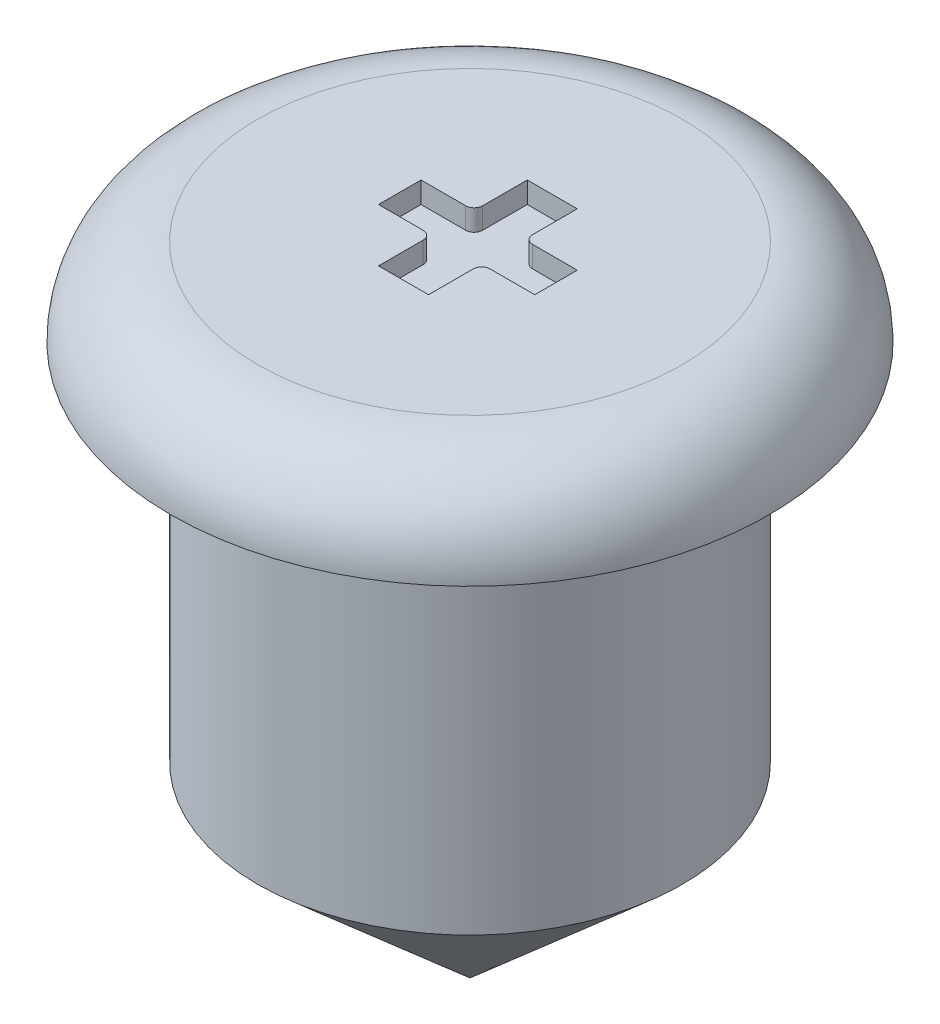
ISO-10303-21;
HEADER;
FILE_DESCRIPTION(('STEP AP214'),'2;1');
FILE_NAME('part.step','',(''),(''),'','','');
FILE_SCHEMA(('AUTOMOTIVE_DESIGN { 1 0 10303 214 1 1 1 1 }'));
ENDSEC;
DATA;
#1=APPLICATION_CONTEXT('core data for automotive mechanical design processes');
#2=APPLICATION_PROTOCOL_DEFINITION('international standard','automotive_design',2000,#1);
#3=PRODUCT_CONTEXT('',#1,'mechanical');
#4=PRODUCT('Part','Part','',(#3));
#5=PRODUCT_RELATED_PRODUCT_CATEGORY('part','',(#4));
#6=PRODUCT_DEFINITION_FORMATION('','',#4);
#7=PRODUCT_DEFINITION_CONTEXT('part definition',#1,'design');
#8=PRODUCT_DEFINITION('design','',#6,#7);
#9=PRODUCT_DEFINITION_SHAPE('','',#8);
#10=(LENGTH_UNIT() NAMED_UNIT(*) SI_UNIT(.MILLI.,.METRE.));
#11=(NAMED_UNIT(*) PLANE_ANGLE_UNIT() SI_UNIT($,.RADIAN.));
#12=(NAMED_UNIT(*) SI_UNIT($,.STERADIAN.) SOLID_ANGLE_UNIT());
#13=UNCERTAINTY_MEASURE_WITH_UNIT(LENGTH_MEASURE(1.E-05),#10,'distance_accuracy_value','');
#14=(GEOMETRIC_REPRESENTATION_CONTEXT(3) GLOBAL_UNCERTAINTY_ASSIGNED_CONTEXT((#13)) GLOBAL_UNIT_ASSIGNED_CONTEXT((#10,
#11,#12)) REPRESENTATION_CONTEXT('',''));
#15=CARTESIAN_POINT('',(0.,0.,0.));
#16=DIRECTION('',(0.,0.,1.));
#17=DIRECTION('',(1.,0.,0.));
#18=AXIS2_PLACEMENT_3D('',#15,#16,#17);
#19=CARTESIAN_POINT('',(0.,-15.8999296053397,0.));
#20=DIRECTION('',(0.,1.,0.));
#21=DIRECTION('',(0.,0.,1.));
#22=AXIS2_PLACEMENT_3D('',#19,#20,#21);
#23=CONICAL_SURFACE('',#22,0.,0.848129261083657);
#24=CARTESIAN_POINT('',(0.,-15.018131929424,0.));
#25=DIRECTION('',(0.,1.,0.));
#26=DIRECTION('',(0.,0.,1.));
#27=AXIS2_PLACEMENT_3D('',#24,#25,#26);
#28=CIRCLE('',#27,1.);
#29=CARTESIAN_POINT('',(0.,-15.018131929424,1.));
#30=VERTEX_POINT('',#29);
#31=EDGE_CURVE('E11',#30,#30,#28,.T.);
#32=ORIENTED_EDGE('',*,*,#31,.F.);
#33=EDGE_LOOP('',(#32));
#34=FACE_BOUND('',#33,.T.);
#35=CARTESIAN_POINT('',(0.,-15.8999296053397,0.));
#36=VERTEX_POINT('',#35);
#37=VERTEX_LOOP('',#36);
#38=FACE_BOUND('',#37,.T.);
#39=ADVANCED_FACE('F45',(#34,#38),#23,.T.);
#40=CARTESIAN_POINT('',(0.,-12.8999296053397,0.));
#41=DIRECTION('',(0.,1.,0.));
#42=DIRECTION('',(0.,0.,1.));
#43=AXIS2_PLACEMENT_3D('',#40,#41,#42);
#44=CYLINDRICAL_SURFACE('',#43,1.);
#45=CARTESIAN_POINT('',(0.,-13.3080014136376,0.));
#46=DIRECTION('',(0.,1.,0.));
#47=DIRECTION('',(0.,0.,1.));
#48=AXIS2_PLACEMENT_3D('',#45,#46,#47);
#49=CIRCLE('',#48,1.);
#50=CARTESIAN_POINT('',(0.,-13.3080014136376,1.));
#51=VERTEX_POINT('',#50);
#52=EDGE_CURVE('E52',#51,#51,#49,.T.);
#53=ORIENTED_EDGE('',*,*,#52,.F.);
#54=EDGE_LOOP('',(#53));
#55=FACE_BOUND('',#54,.T.);
#56=ORIENTED_EDGE('',*,*,#31,.T.);
#57=EDGE_LOOP('',(#56));
#58=FACE_BOUND('',#57,.T.);
#59=ADVANCED_FACE('F301',(#55,#58),#44,.T.);
#60=CARTESIAN_POINT('',(1.40807180829788,-13.3080014136376,0.));
#61=DIRECTION('',(0.,1.,0.));
#62=DIRECTION('',(0.,0.,1.));
#63=AXIS2_PLACEMENT_3D('',#60,#61,#62);
#64=PLANE('',#63);
#65=CARTESIAN_POINT('',(0.,-13.3080014136376,0.));
#66=DIRECTION('',(0.,1.,0.));
#67=DIRECTION('',(0.,0.,1.));
#68=AXIS2_PLACEMENT_3D('',#65,#66,#67);
#69=CIRCLE('',#68,1.40807180829788);
#70=CARTESIAN_POINT('',(0.,-13.3080014136376,1.40807180829788));
#71=VERTEX_POINT('',#70);
#72=EDGE_CURVE('E294',#71,#71,#69,.T.);
#73=ORIENTED_EDGE('',*,*,#72,.F.);
#74=EDGE_LOOP('',(#73));
#75=FACE_BOUND('',#74,.T.);
#76=ORIENTED_EDGE('',*,*,#52,.T.);
#77=EDGE_LOOP('',(#76));
#78=FACE_BOUND('',#77,.T.);
#79=ADVANCED_FACE('F299',(#75,#78),#64,.F.);
#80=CARTESIAN_POINT('',(0.,-13.3080014136376,0.));
#81=DIRECTION('',(0.,1.,0.));
#82=DIRECTION('',(0.,0.,1.));
#83=AXIS2_PLACEMENT_3D('',#80,#81,#82);
#84=TOROIDAL_SURFACE('',#83,1.,0.408071808297883);
#85=CARTESIAN_POINT('',(0.,-12.8999296053397,0.));
#86=DIRECTION('',(0.,1.,0.));
#87=DIRECTION('',(0.,0.,1.));
#88=AXIS2_PLACEMENT_3D('',#85,#86,#87);
#89=CIRCLE('',#88,1.);
#90=CARTESIAN_POINT('',(0.,-12.8999296053397,1.));
#91=VERTEX_POINT('',#90);
#92=EDGE_CURVE('E264',#91,#91,#89,.T.);
#93=ORIENTED_EDGE('',*,*,#92,.F.);
#94=EDGE_LOOP('',(#93));
#95=FACE_BOUND('',#94,.T.);
#96=ORIENTED_EDGE('',*,*,#72,.T.);
#97=EDGE_LOOP('',(#96));
#98=FACE_BOUND('',#97,.T.);
#99=ADVANCED_FACE('F320',(#95,#98),#84,.T.);
#100=CARTESIAN_POINT('',(1.,-12.8999296053397,0.));
#101=DIRECTION('',(0.,-1.,0.));
#102=DIRECTION('',(0.,0.,-1.));
#103=AXIS2_PLACEMENT_3D('',#100,#101,#102);
#104=PLANE('',#103);
#105=DIRECTION('',(-1.,0.,0.));
#106=VECTOR('',#105,1.);
#107=CARTESIAN_POINT('',(-0.117632759443697,-12.8999296053397,-0.387224573028196));
#108=LINE('',#107,#106);
#109=CARTESIAN_POINT('',(0.117632759443697,-12.8999296053397,-0.387224573028196));
#110=VERTEX_POINT('',#109);
#111=CARTESIAN_POINT('',(-0.117632759443697,-12.8999296053397,-0.387224573028196));
#112=VERTEX_POINT('',#111);
#113=EDGE_CURVE('E222',#110,#112,#108,.T.);
#114=ORIENTED_EDGE('',*,*,#113,.F.);
#115=DIRECTION('',(0.,0.,-1.));
#116=VECTOR('',#115,1.);
#117=CARTESIAN_POINT('',(0.117632759443697,-12.8999296053397,-0.387224573028196));
#118=LINE('',#117,#116);
#119=CARTESIAN_POINT('',(0.117632759443697,-12.8999296053397,-0.177224573028196));
#120=VERTEX_POINT('',#119);
#121=EDGE_CURVE('E59',#120,#110,#118,.T.);
#122=ORIENTED_EDGE('',*,*,#121,.F.);
#123=CARTESIAN_POINT('',(0.157632759443697,-12.8999296053397,-0.177224573028196));
#124=DIRECTION('',(0.,-1.,0.));
#125=DIRECTION('',(0.,0.,1.));
#126=AXIS2_PLACEMENT_3D('',#123,#124,#125);
#127=CIRCLE('',#126,0.04);
#128=CARTESIAN_POINT('',(0.157632759443697,-12.8999296053397,-0.137224573028196));
#129=VERTEX_POINT('',#128);
#130=EDGE_CURVE('E178',#129,#120,#127,.T.);
#131=ORIENTED_EDGE('',*,*,#130,.F.);
#132=DIRECTION('',(-1.,0.,0.));
#133=VECTOR('',#132,1.);
#134=CARTESIAN_POINT('',(0.157632759443697,-12.8999296053397,-0.137224573028196));
#135=LINE('',#134,#133);
#136=CARTESIAN_POINT('',(0.367632759443697,-12.8999296053397,-0.137224573028196));
#137=VERTEX_POINT('',#136);
#138=EDGE_CURVE('E181',#137,#129,#135,.T.);
#139=ORIENTED_EDGE('',*,*,#138,.F.);
#140=DIRECTION('',(0.,0.,-1.));
#141=VECTOR('',#140,1.);
#142=CARTESIAN_POINT('',(0.367632759443697,-12.8999296053397,-0.137224573028196));
#143=LINE('',#142,#141);
#144=CARTESIAN_POINT('',(0.367632759443697,-12.8999296053397,0.0627754269718038));
#145=VERTEX_POINT('',#144);
#146=EDGE_CURVE('E257',#145,#137,#143,.T.);
#147=ORIENTED_EDGE('',*,*,#146,.F.);
#148=DIRECTION('',(1.,0.,0.));
#149=VECTOR('',#148,1.);
#150=CARTESIAN_POINT('',(0.367632759443697,-12.8999296053397,0.0627754269718038));
#151=LINE('',#150,#149);
#152=CARTESIAN_POINT('',(0.157632759443697,-12.8999296053397,0.0627754269718039));
#153=VERTEX_POINT('',#152);
#154=EDGE_CURVE('E254',#153,#145,#151,.T.);
#155=ORIENTED_EDGE('',*,*,#154,.F.);
#156=CARTESIAN_POINT('',(0.157632759443697,-12.8999296053397,0.102775426971804));
#157=DIRECTION('',(0.,-1.,0.));
#158=DIRECTION('',(0.,0.,1.));
#159=AXIS2_PLACEMENT_3D('',#156,#157,#158);
#160=CIRCLE('',#159,0.04);
#161=CARTESIAN_POINT('',(0.117632759443697,-12.8999296053397,0.102775426971804));
#162=VERTEX_POINT('',#161);
#163=EDGE_CURVE('E251',#162,#153,#160,.T.);
#164=ORIENTED_EDGE('',*,*,#163,.F.);
#165=DIRECTION('',(0.,0.,-1.));
#166=VECTOR('',#165,1.);
#167=CARTESIAN_POINT('',(0.117632759443697,-12.8999296053397,0.102775426971804));
#168=LINE('',#167,#166);
#169=CARTESIAN_POINT('',(0.117632759443697,-12.8999296053397,0.312775426971804));
#170=VERTEX_POINT('',#169);
#171=EDGE_CURVE('E248',#170,#162,#168,.T.);
#172=ORIENTED_EDGE('',*,*,#171,.F.);
#173=DIRECTION('',(1.,0.,0.));
#174=VECTOR('',#173,1.);
#175=CARTESIAN_POINT('',(0.117632759443697,-12.8999296053397,0.312775426971804));
#176=LINE('',#175,#174);
#177=CARTESIAN_POINT('',(-0.117632759443697,-12.8999296053397,0.312775426971804));
#178=VERTEX_POINT('',#177);
#179=EDGE_CURVE('E245',#178,#170,#176,.T.);
#180=ORIENTED_EDGE('',*,*,#179,.F.);
#181=DIRECTION('',(0.,0.,1.));
#182=VECTOR('',#181,1.);
#183=CARTESIAN_POINT('',(-0.117632759443697,-12.8999296053397,0.102775426971804));
#184=LINE('',#183,#182);
#185=CARTESIAN_POINT('',(-0.117632759443697,-12.8999296053397,0.102775426971804));
#186=VERTEX_POINT('',#185);
#187=EDGE_CURVE('E242',#186,#178,#184,.T.);
#188=ORIENTED_EDGE('',*,*,#187,.F.);
#189=CARTESIAN_POINT('',(-0.157632759443697,-12.8999296053397,0.102775426971804));
#190=DIRECTION('',(0.,-1.,0.));
#191=DIRECTION('',(0.,0.,-1.));
#192=AXIS2_PLACEMENT_3D('',#189,#190,#191);
#193=CIRCLE('',#192,0.04);
#194=CARTESIAN_POINT('',(-0.157632759443697,-12.8999296053397,0.0627754269718039));
#195=VERTEX_POINT('',#194);
#196=EDGE_CURVE('E239',#195,#186,#193,.T.);
#197=ORIENTED_EDGE('',*,*,#196,.F.);
#198=DIRECTION('',(1.,0.,0.));
#199=VECTOR('',#198,1.);
#200=CARTESIAN_POINT('',(-0.367632759443697,-12.8999296053397,0.0627754269718039));
#201=LINE('',#200,#199);
#202=CARTESIAN_POINT('',(-0.367632759443697,-12.8999296053397,0.0627754269718039));
#203=VERTEX_POINT('',#202);
#204=EDGE_CURVE('E236',#203,#195,#201,.T.);
#205=ORIENTED_EDGE('',*,*,#204,.F.);
#206=DIRECTION('',(0.,0.,1.));
#207=VECTOR('',#206,1.);
#208=CARTESIAN_POINT('',(-0.367632759443697,-12.8999296053397,-0.137224573028196));
#209=LINE('',#208,#207);
#210=CARTESIAN_POINT('',(-0.367632759443697,-12.8999296053397,-0.137224573028196));
#211=VERTEX_POINT('',#210);
#212=EDGE_CURVE('E233',#211,#203,#209,.T.);
#213=ORIENTED_EDGE('',*,*,#212,.F.);
#214=DIRECTION('',(-1.,0.,0.));
#215=VECTOR('',#214,1.);
#216=CARTESIAN_POINT('',(-0.157632759443697,-12.8999296053397,-0.137224573028196));
#217=LINE('',#216,#215);
#218=CARTESIAN_POINT('',(-0.157632759443697,-12.8999296053397,-0.137224573028196));
#219=VERTEX_POINT('',#218);
#220=EDGE_CURVE('E230',#219,#211,#217,.T.);
#221=ORIENTED_EDGE('',*,*,#220,.F.);
#222=CARTESIAN_POINT('',(-0.157632759443697,-12.8999296053397,-0.177224573028196));
#223=DIRECTION('',(0.,-1.,0.));
#224=DIRECTION('',(0.,0.,-1.));
#225=AXIS2_PLACEMENT_3D('',#222,#223,#224);
#226=CIRCLE('',#225,0.04);
#227=CARTESIAN_POINT('',(-0.117632759443697,-12.8999296053397,-0.177224573028196));
#228=VERTEX_POINT('',#227);
#229=EDGE_CURVE('E227',#228,#219,#226,.T.);
#230=ORIENTED_EDGE('',*,*,#229,.F.);
#231=DIRECTION('',(0.,0.,1.));
#232=VECTOR('',#231,1.);
#233=CARTESIAN_POINT('',(-0.117632759443697,-12.8999296053397,-0.387224573028196));
#234=LINE('',#233,#232);
#235=EDGE_CURVE('E224',#112,#228,#234,.T.);
#236=ORIENTED_EDGE('',*,*,#235,.F.);
#237=EDGE_LOOP('',(#114,#122,#131,#139,#147,#155,#164,#172,#180,#188,#197,#205,#213,#221,#230,#236));
#238=FACE_BOUND('',#237,.T.);
#239=ORIENTED_EDGE('',*,*,#92,.T.);
#240=EDGE_LOOP('',(#239));
#241=FACE_BOUND('',#240,.T.);
#242=ADVANCED_FACE('F329',(#238,#241),#104,.F.);
#243=CARTESIAN_POINT('',(0.117632759443697,-12.9999296053397,-0.387224573028196));
#244=DIRECTION('',(1.,0.,0.));
#245=DIRECTION('',(0.,0.,-1.));
#246=AXIS2_PLACEMENT_3D('',#243,#244,#245);
#247=PLANE('',#246);
#248=ORIENTED_EDGE('',*,*,#121,.T.);
#249=DIRECTION('',(0.,1.,0.));
#250=VECTOR('',#249,1.);
#251=CARTESIAN_POINT('',(0.117632759443697,-12.9999296053397,-0.387224573028196));
#252=LINE('',#251,#250);
#253=CARTESIAN_POINT('',(0.117632759443697,-12.9999296053397,-0.387224573028196));
#254=VERTEX_POINT('',#253);
#255=EDGE_CURVE('E155',#254,#110,#252,.T.);
#256=ORIENTED_EDGE('',*,*,#255,.F.);
#257=DIRECTION('',(0.,0.,-1.));
#258=VECTOR('',#257,1.);
#259=CARTESIAN_POINT('',(0.117632759443697,-12.9999296053397,-0.387224573028196));
#260=LINE('',#259,#258);
#261=CARTESIAN_POINT('',(0.117632759443697,-12.9999296053397,-0.177224573028196));
#262=VERTEX_POINT('',#261);
#263=EDGE_CURVE('E159',#262,#254,#260,.T.);
#264=ORIENTED_EDGE('',*,*,#263,.F.);
#265=DIRECTION('',(0.,1.,0.));
#266=VECTOR('',#265,1.);
#267=CARTESIAN_POINT('',(0.117632759443697,-12.9999296053397,-0.177224573028196));
#268=LINE('',#267,#266);
#269=EDGE_CURVE('E262',#262,#120,#268,.T.);
#270=ORIENTED_EDGE('',*,*,#269,.T.);
#271=EDGE_LOOP('',(#248,#256,#264,#270));
#272=FACE_BOUND('',#271,.T.);
#273=ADVANCED_FACE('F157',(#272),#247,.F.);
#274=CARTESIAN_POINT('',(0.157632759443697,-12.9999296053397,-0.177224573028196));
#275=DIRECTION('',(0.,1.,0.));
#276=DIRECTION('',(0.,0.,1.));
#277=AXIS2_PLACEMENT_3D('',#274,#275,#276);
#278=CYLINDRICAL_SURFACE('',#277,0.04);
#279=ORIENTED_EDGE('',*,*,#130,.T.);
#280=ORIENTED_EDGE('',*,*,#269,.F.);
#281=CARTESIAN_POINT('',(0.157632759443697,-12.9999296053397,-0.177224573028196));
#282=DIRECTION('',(0.,-1.,0.));
#283=DIRECTION('',(0.,0.,1.));
#284=AXIS2_PLACEMENT_3D('',#281,#282,#283);
#285=CIRCLE('',#284,0.04);
#286=CARTESIAN_POINT('',(0.157632759443697,-12.9999296053397,-0.137224573028196));
#287=VERTEX_POINT('',#286);
#288=EDGE_CURVE('E165',#287,#262,#285,.T.);
#289=ORIENTED_EDGE('',*,*,#288,.F.);
#290=DIRECTION('',(0.,1.,0.));
#291=VECTOR('',#290,1.);
#292=CARTESIAN_POINT('',(0.157632759443697,-12.9999296053397,-0.137224573028196));
#293=LINE('',#292,#291);
#294=EDGE_CURVE('E265',#287,#129,#293,.T.);
#295=ORIENTED_EDGE('',*,*,#294,.T.);
#296=EDGE_LOOP('',(#279,#280,#289,#295));
#297=FACE_BOUND('',#296,.T.);
#298=ADVANCED_FACE('F344',(#297),#278,.T.);
#299=CARTESIAN_POINT('',(0.157632759443697,-12.9999296053397,-0.137224573028196));
#300=DIRECTION('',(0.,0.,-1.));
#301=DIRECTION('',(-1.,0.,0.));
#302=AXIS2_PLACEMENT_3D('',#299,#300,#301);
#303=PLANE('',#302);
#304=ORIENTED_EDGE('',*,*,#138,.T.);
#305=ORIENTED_EDGE('',*,*,#294,.F.);
#306=DIRECTION('',(-1.,0.,0.));
#307=VECTOR('',#306,1.);
#308=CARTESIAN_POINT('',(0.157632759443697,-12.9999296053397,-0.137224573028196));
#309=LINE('',#308,#307);
#310=CARTESIAN_POINT('',(0.367632759443697,-12.9999296053397,-0.137224573028196));
#311=VERTEX_POINT('',#310);
#312=EDGE_CURVE('E218',#311,#287,#309,.T.);
#313=ORIENTED_EDGE('',*,*,#312,.F.);
#314=DIRECTION('',(0.,1.,0.));
#315=VECTOR('',#314,1.);
#316=CARTESIAN_POINT('',(0.367632759443697,-12.9999296053397,-0.137224573028196));
#317=LINE('',#316,#315);
#318=EDGE_CURVE('E267',#311,#137,#317,.T.);
#319=ORIENTED_EDGE('',*,*,#318,.T.);
#320=EDGE_LOOP('',(#304,#305,#313,#319));
#321=FACE_BOUND('',#320,.T.);
#322=ADVANCED_FACE('F351',(#321),#303,.F.);
#323=CARTESIAN_POINT('',(0.367632759443697,-12.9999296053397,-0.137224573028196));
#324=DIRECTION('',(1.,0.,0.));
#325=DIRECTION('',(0.,0.,-1.));
#326=AXIS2_PLACEMENT_3D('',#323,#324,#325);
#327=PLANE('',#326);
#328=ORIENTED_EDGE('',*,*,#146,.T.);
#329=ORIENTED_EDGE('',*,*,#318,.F.);
#330=DIRECTION('',(0.,0.,-1.));
#331=VECTOR('',#330,1.);
#332=CARTESIAN_POINT('',(0.367632759443697,-12.9999296053397,-0.137224573028196));
#333=LINE('',#332,#331);
#334=CARTESIAN_POINT('',(0.367632759443697,-12.9999296053397,0.0627754269718038));
#335=VERTEX_POINT('',#334);
#336=EDGE_CURVE('E215',#335,#311,#333,.T.);
#337=ORIENTED_EDGE('',*,*,#336,.F.);
#338=DIRECTION('',(0.,1.,0.));
#339=VECTOR('',#338,1.);
#340=CARTESIAN_POINT('',(0.367632759443697,-12.9999296053397,0.0627754269718038));
#341=LINE('',#340,#339);
#342=EDGE_CURVE('E269',#335,#145,#341,.T.);
#343=ORIENTED_EDGE('',*,*,#342,.T.);
#344=EDGE_LOOP('',(#328,#329,#337,#343));
#345=FACE_BOUND('',#344,.T.);
#346=ADVANCED_FACE('F359',(#345),#327,.F.);
#347=CARTESIAN_POINT('',(0.367632759443697,-12.9999296053397,0.0627754269718038));
#348=DIRECTION('',(0.,0.,1.));
#349=DIRECTION('',(1.,0.,0.));
#350=AXIS2_PLACEMENT_3D('',#347,#348,#349);
#351=PLANE('',#350);
#352=ORIENTED_EDGE('',*,*,#154,.T.);
#353=ORIENTED_EDGE('',*,*,#342,.F.);
#354=DIRECTION('',(1.,0.,0.));
#355=VECTOR('',#354,1.);
#356=CARTESIAN_POINT('',(0.367632759443697,-12.9999296053397,0.0627754269718038));
#357=LINE('',#356,#355);
#358=CARTESIAN_POINT('',(0.157632759443697,-12.9999296053397,0.0627754269718039));
#359=VERTEX_POINT('',#358);
#360=EDGE_CURVE('E212',#359,#335,#357,.T.);
#361=ORIENTED_EDGE('',*,*,#360,.F.);
#362=DIRECTION('',(0.,1.,0.));
#363=VECTOR('',#362,1.);
#364=CARTESIAN_POINT('',(0.157632759443697,-12.9999296053397,0.0627754269718039));
#365=LINE('',#364,#363);
#366=EDGE_CURVE('E271',#359,#153,#365,.T.);
#367=ORIENTED_EDGE('',*,*,#366,.T.);
#368=EDGE_LOOP('',(#352,#353,#361,#367));
#369=FACE_BOUND('',#368,.T.);
#370=ADVANCED_FACE('F367',(#369),#351,.F.);
#371=CARTESIAN_POINT('',(0.157632759443697,-12.9999296053397,0.102775426971804));
#372=DIRECTION('',(0.,1.,0.));
#373=DIRECTION('',(0.,0.,1.));
#374=AXIS2_PLACEMENT_3D('',#371,#372,#373);
#375=CYLINDRICAL_SURFACE('',#374,0.04);
#376=ORIENTED_EDGE('',*,*,#163,.T.);
#377=ORIENTED_EDGE('',*,*,#366,.F.);
#378=CARTESIAN_POINT('',(0.157632759443697,-12.9999296053397,0.102775426971804));
#379=DIRECTION('',(0.,-1.,0.));
#380=DIRECTION('',(0.,0.,1.));
#381=AXIS2_PLACEMENT_3D('',#378,#379,#380);
#382=CIRCLE('',#381,0.04);
#383=CARTESIAN_POINT('',(0.117632759443697,-12.9999296053397,0.102775426971804));
#384=VERTEX_POINT('',#383);
#385=EDGE_CURVE('E209',#384,#359,#382,.T.);
#386=ORIENTED_EDGE('',*,*,#385,.F.);
#387=DIRECTION('',(0.,1.,0.));
#388=VECTOR('',#387,1.);
#389=CARTESIAN_POINT('',(0.117632759443697,-12.9999296053397,0.102775426971804));
#390=LINE('',#389,#388);
#391=EDGE_CURVE('E273',#384,#162,#390,.T.);
#392=ORIENTED_EDGE('',*,*,#391,.T.);
#393=EDGE_LOOP('',(#376,#377,#386,#392));
#394=FACE_BOUND('',#393,.T.);
#395=ADVANCED_FACE('F375',(#394),#375,.T.);
#396=CARTESIAN_POINT('',(0.117632759443697,-12.9999296053397,0.102775426971804));
#397=DIRECTION('',(1.,0.,0.));
#398=DIRECTION('',(0.,0.,-1.));
#399=AXIS2_PLACEMENT_3D('',#396,#397,#398);
#400=PLANE('',#399);
#401=ORIENTED_EDGE('',*,*,#171,.T.);
#402=ORIENTED_EDGE('',*,*,#391,.F.);
#403=DIRECTION('',(0.,0.,-1.));
#404=VECTOR('',#403,1.);
#405=CARTESIAN_POINT('',(0.117632759443697,-12.9999296053397,0.102775426971804));
#406=LINE('',#405,#404);
#407=CARTESIAN_POINT('',(0.117632759443697,-12.9999296053397,0.312775426971804));
#408=VERTEX_POINT('',#407);
#409=EDGE_CURVE('E206',#408,#384,#406,.T.);
#410=ORIENTED_EDGE('',*,*,#409,.F.);
#411=DIRECTION('',(0.,1.,0.));
#412=VECTOR('',#411,1.);
#413=CARTESIAN_POINT('',(0.117632759443697,-12.9999296053397,0.312775426971804));
#414=LINE('',#413,#412);
#415=EDGE_CURVE('E275',#408,#170,#414,.T.);
#416=ORIENTED_EDGE('',*,*,#415,.T.);
#417=EDGE_LOOP('',(#401,#402,#410,#416));
#418=FACE_BOUND('',#417,.T.);
#419=ADVANCED_FACE('F383',(#418),#400,.F.);
#420=CARTESIAN_POINT('',(0.117632759443697,-12.9999296053397,0.312775426971804));
#421=DIRECTION('',(0.,0.,1.));
#422=DIRECTION('',(1.,0.,0.));
#423=AXIS2_PLACEMENT_3D('',#420,#421,#422);
#424=PLANE('',#423);
#425=ORIENTED_EDGE('',*,*,#179,.T.);
#426=ORIENTED_EDGE('',*,*,#415,.F.);
#427=DIRECTION('',(1.,0.,0.));
#428=VECTOR('',#427,1.);
#429=CARTESIAN_POINT('',(0.117632759443697,-12.9999296053397,0.312775426971804));
#430=LINE('',#429,#428);
#431=CARTESIAN_POINT('',(-0.117632759443697,-12.9999296053397,0.312775426971804));
#432=VERTEX_POINT('',#431);
#433=EDGE_CURVE('E203',#432,#408,#430,.T.);
#434=ORIENTED_EDGE('',*,*,#433,.F.);
#435=DIRECTION('',(0.,1.,0.));
#436=VECTOR('',#435,1.);
#437=CARTESIAN_POINT('',(-0.117632759443697,-12.9999296053397,0.312775426971804));
#438=LINE('',#437,#436);
#439=EDGE_CURVE('E277',#432,#178,#438,.T.);
#440=ORIENTED_EDGE('',*,*,#439,.T.);
#441=EDGE_LOOP('',(#425,#426,#434,#440));
#442=FACE_BOUND('',#441,.T.);
#443=ADVANCED_FACE('F391',(#442),#424,.F.);
#444=CARTESIAN_POINT('',(-0.117632759443697,-12.9999296053397,0.102775426971804));
#445=DIRECTION('',(-1.,0.,0.));
#446=DIRECTION('',(0.,0.,1.));
#447=AXIS2_PLACEMENT_3D('',#444,#445,#446);
#448=PLANE('',#447);
#449=ORIENTED_EDGE('',*,*,#187,.T.);
#450=ORIENTED_EDGE('',*,*,#439,.F.);
#451=DIRECTION('',(0.,0.,1.));
#452=VECTOR('',#451,1.);
#453=CARTESIAN_POINT('',(-0.117632759443697,-12.9999296053397,0.102775426971804));
#454=LINE('',#453,#452);
#455=CARTESIAN_POINT('',(-0.117632759443697,-12.9999296053397,0.102775426971804));
#456=VERTEX_POINT('',#455);
#457=EDGE_CURVE('E200',#456,#432,#454,.T.);
#458=ORIENTED_EDGE('',*,*,#457,.F.);
#459=DIRECTION('',(0.,1.,0.));
#460=VECTOR('',#459,1.);
#461=CARTESIAN_POINT('',(-0.117632759443697,-12.9999296053397,0.102775426971804));
#462=LINE('',#461,#460);
#463=EDGE_CURVE('E279',#456,#186,#462,.T.);
#464=ORIENTED_EDGE('',*,*,#463,.T.);
#465=EDGE_LOOP('',(#449,#450,#458,#464));
#466=FACE_BOUND('',#465,.T.);
#467=ADVANCED_FACE('F399',(#466),#448,.F.);
#468=CARTESIAN_POINT('',(-0.157632759443697,-12.9999296053397,0.102775426971804));
#469=DIRECTION('',(0.,1.,0.));
#470=DIRECTION('',(0.,0.,1.));
#471=AXIS2_PLACEMENT_3D('',#468,#469,#470);
#472=CYLINDRICAL_SURFACE('',#471,0.04);
#473=ORIENTED_EDGE('',*,*,#196,.T.);
#474=ORIENTED_EDGE('',*,*,#463,.F.);
#475=CARTESIAN_POINT('',(-0.157632759443697,-12.9999296053397,0.102775426971804));
#476=DIRECTION('',(0.,-1.,0.));
#477=DIRECTION('',(0.,0.,-1.));
#478=AXIS2_PLACEMENT_3D('',#475,#476,#477);
#479=CIRCLE('',#478,0.04);
#480=CARTESIAN_POINT('',(-0.157632759443697,-12.9999296053397,0.0627754269718039));
#481=VERTEX_POINT('',#480);
#482=EDGE_CURVE('E197',#481,#456,#479,.T.);
#483=ORIENTED_EDGE('',*,*,#482,.F.);
#484=DIRECTION('',(0.,1.,0.));
#485=VECTOR('',#484,1.);
#486=CARTESIAN_POINT('',(-0.157632759443697,-12.9999296053397,0.0627754269718039));
#487=LINE('',#486,#485);
#488=EDGE_CURVE('E281',#481,#195,#487,.T.);
#489=ORIENTED_EDGE('',*,*,#488,.T.);
#490=EDGE_LOOP('',(#473,#474,#483,#489));
#491=FACE_BOUND('',#490,.T.);
#492=ADVANCED_FACE('F407',(#491),#472,.T.);
#493=CARTESIAN_POINT('',(-0.367632759443697,-12.9999296053397,0.0627754269718039));
#494=DIRECTION('',(0.,0.,1.));
#495=DIRECTION('',(1.,0.,0.));
#496=AXIS2_PLACEMENT_3D('',#493,#494,#495);
#497=PLANE('',#496);
#498=ORIENTED_EDGE('',*,*,#204,.T.);
#499=ORIENTED_EDGE('',*,*,#488,.F.);
#500=DIRECTION('',(1.,0.,0.));
#501=VECTOR('',#500,1.);
#502=CARTESIAN_POINT('',(-0.367632759443697,-12.9999296053397,0.0627754269718039));
#503=LINE('',#502,#501);
#504=CARTESIAN_POINT('',(-0.367632759443697,-12.9999296053397,0.0627754269718039));
#505=VERTEX_POINT('',#504);
#506=EDGE_CURVE('E194',#505,#481,#503,.T.);
#507=ORIENTED_EDGE('',*,*,#506,.F.);
#508=DIRECTION('',(0.,1.,0.));
#509=VECTOR('',#508,1.);
#510=CARTESIAN_POINT('',(-0.367632759443697,-12.9999296053397,0.0627754269718039));
#511=LINE('',#510,#509);
#512=EDGE_CURVE('E283',#505,#203,#511,.T.);
#513=ORIENTED_EDGE('',*,*,#512,.T.);
#514=EDGE_LOOP('',(#498,#499,#507,#513));
#515=FACE_BOUND('',#514,.T.);
#516=ADVANCED_FACE('F415',(#515),#497,.F.);
#517=CARTESIAN_POINT('',(-0.367632759443697,-12.9999296053397,-0.137224573028196));
#518=DIRECTION('',(-1.,0.,0.));
#519=DIRECTION('',(0.,0.,1.));
#520=AXIS2_PLACEMENT_3D('',#517,#518,#519);
#521=PLANE('',#520);
#522=ORIENTED_EDGE('',*,*,#212,.T.);
#523=ORIENTED_EDGE('',*,*,#512,.F.);
#524=DIRECTION('',(0.,0.,1.));
#525=VECTOR('',#524,1.);
#526=CARTESIAN_POINT('',(-0.367632759443697,-12.9999296053397,-0.137224573028196));
#527=LINE('',#526,#525);
#528=CARTESIAN_POINT('',(-0.367632759443697,-12.9999296053397,-0.137224573028196));
#529=VERTEX_POINT('',#528);
#530=EDGE_CURVE('E191',#529,#505,#527,.T.);
#531=ORIENTED_EDGE('',*,*,#530,.F.);
#532=DIRECTION('',(0.,1.,0.));
#533=VECTOR('',#532,1.);
#534=CARTESIAN_POINT('',(-0.367632759443697,-12.9999296053397,-0.137224573028196));
#535=LINE('',#534,#533);
#536=EDGE_CURVE('E285',#529,#211,#535,.T.);
#537=ORIENTED_EDGE('',*,*,#536,.T.);
#538=EDGE_LOOP('',(#522,#523,#531,#537));
#539=FACE_BOUND('',#538,.T.);
#540=ADVANCED_FACE('F423',(#539),#521,.F.);
#541=CARTESIAN_POINT('',(-0.157632759443697,-12.9999296053397,-0.137224573028196));
#542=DIRECTION('',(0.,0.,-1.));
#543=DIRECTION('',(-1.,0.,0.));
#544=AXIS2_PLACEMENT_3D('',#541,#542,#543);
#545=PLANE('',#544);
#546=ORIENTED_EDGE('',*,*,#220,.T.);
#547=ORIENTED_EDGE('',*,*,#536,.F.);
#548=DIRECTION('',(-1.,0.,0.));
#549=VECTOR('',#548,1.);
#550=CARTESIAN_POINT('',(-0.157632759443697,-12.9999296053397,-0.137224573028196));
#551=LINE('',#550,#549);
#552=CARTESIAN_POINT('',(-0.157632759443697,-12.9999296053397,-0.137224573028196));
#553=VERTEX_POINT('',#552);
#554=EDGE_CURVE('E188',#553,#529,#551,.T.);
#555=ORIENTED_EDGE('',*,*,#554,.F.);
#556=DIRECTION('',(0.,1.,0.));
#557=VECTOR('',#556,1.);
#558=CARTESIAN_POINT('',(-0.157632759443697,-12.9999296053397,-0.137224573028196));
#559=LINE('',#558,#557);
#560=EDGE_CURVE('E287',#553,#219,#559,.T.);
#561=ORIENTED_EDGE('',*,*,#560,.T.);
#562=EDGE_LOOP('',(#546,#547,#555,#561));
#563=FACE_BOUND('',#562,.T.);
#564=ADVANCED_FACE('F431',(#563),#545,.F.);
#565=CARTESIAN_POINT('',(-0.157632759443697,-12.9999296053397,-0.177224573028196));
#566=DIRECTION('',(0.,1.,0.));
#567=DIRECTION('',(0.,0.,1.));
#568=AXIS2_PLACEMENT_3D('',#565,#566,#567);
#569=CYLINDRICAL_SURFACE('',#568,0.04);
#570=ORIENTED_EDGE('',*,*,#229,.T.);
#571=ORIENTED_EDGE('',*,*,#560,.F.);
#572=CARTESIAN_POINT('',(-0.157632759443697,-12.9999296053397,-0.177224573028196));
#573=DIRECTION('',(0.,-1.,0.));
#574=DIRECTION('',(0.,0.,-1.));
#575=AXIS2_PLACEMENT_3D('',#572,#573,#574);
#576=CIRCLE('',#575,0.04);
#577=CARTESIAN_POINT('',(-0.117632759443697,-12.9999296053397,-0.177224573028196));
#578=VERTEX_POINT('',#577);
#579=EDGE_CURVE('E185',#578,#553,#576,.T.);
#580=ORIENTED_EDGE('',*,*,#579,.F.);
#581=DIRECTION('',(0.,1.,0.));
#582=VECTOR('',#581,1.);
#583=CARTESIAN_POINT('',(-0.117632759443697,-12.9999296053397,-0.177224573028196));
#584=LINE('',#583,#582);
#585=EDGE_CURVE('E289',#578,#228,#584,.T.);
#586=ORIENTED_EDGE('',*,*,#585,.T.);
#587=EDGE_LOOP('',(#570,#571,#580,#586));
#588=FACE_BOUND('',#587,.T.);
#589=ADVANCED_FACE('F439',(#588),#569,.T.);
#590=CARTESIAN_POINT('',(-0.117632759443697,-12.9999296053397,-0.387224573028196));
#591=DIRECTION('',(-1.,0.,0.));
#592=DIRECTION('',(0.,0.,1.));
#593=AXIS2_PLACEMENT_3D('',#590,#591,#592);
#594=PLANE('',#593);
#595=ORIENTED_EDGE('',*,*,#235,.T.);
#596=ORIENTED_EDGE('',*,*,#585,.F.);
#597=DIRECTION('',(0.,0.,1.));
#598=VECTOR('',#597,1.);
#599=CARTESIAN_POINT('',(-0.117632759443697,-12.9999296053397,-0.387224573028196));
#600=LINE('',#599,#598);
#601=CARTESIAN_POINT('',(-0.117632759443697,-12.9999296053397,-0.387224573028196));
#602=VERTEX_POINT('',#601);
#603=EDGE_CURVE('E173',#602,#578,#600,.T.);
#604=ORIENTED_EDGE('',*,*,#603,.F.);
#605=DIRECTION('',(0.,1.,0.));
#606=VECTOR('',#605,1.);
#607=CARTESIAN_POINT('',(-0.117632759443697,-12.9999296053397,-0.387224573028196));
#608=LINE('',#607,#606);
#609=EDGE_CURVE('E164',#602,#112,#608,.T.);
#610=ORIENTED_EDGE('',*,*,#609,.T.);
#611=EDGE_LOOP('',(#595,#596,#604,#610));
#612=FACE_BOUND('',#611,.T.);
#613=ADVANCED_FACE('F447',(#612),#594,.F.);
#614=CARTESIAN_POINT('',(-0.117632759443697,-12.9999296053397,-0.387224573028196));
#615=DIRECTION('',(0.,0.,-1.));
#616=DIRECTION('',(-1.,0.,0.));
#617=AXIS2_PLACEMENT_3D('',#614,#615,#616);
#618=PLANE('',#617);
#619=ORIENTED_EDGE('',*,*,#113,.T.);
#620=ORIENTED_EDGE('',*,*,#609,.F.);
#621=DIRECTION('',(-1.,0.,0.));
#622=VECTOR('',#621,1.);
#623=CARTESIAN_POINT('',(-0.117632759443697,-12.9999296053397,-0.387224573028196));
#624=LINE('',#623,#622);
#625=EDGE_CURVE('E168',#254,#602,#624,.T.);
#626=ORIENTED_EDGE('',*,*,#625,.F.);
#627=ORIENTED_EDGE('',*,*,#255,.T.);
#628=EDGE_LOOP('',(#619,#620,#626,#627));
#629=FACE_BOUND('',#628,.T.);
#630=ADVANCED_FACE('F169',(#629),#618,.F.);
#631=CARTESIAN_POINT('',(0.157632759443697,-12.9999296053397,-0.177224573028196));
#632=DIRECTION('',(0.,1.,0.));
#633=DIRECTION('',(0.,0.,1.));
#634=AXIS2_PLACEMENT_3D('',#631,#632,#633);
#635=PLANE('',#634);
#636=ORIENTED_EDGE('',*,*,#263,.T.);
#637=ORIENTED_EDGE('',*,*,#625,.T.);
#638=ORIENTED_EDGE('',*,*,#603,.T.);
#639=ORIENTED_EDGE('',*,*,#579,.T.);
#640=ORIENTED_EDGE('',*,*,#554,.T.);
#641=ORIENTED_EDGE('',*,*,#530,.T.);
#642=ORIENTED_EDGE('',*,*,#506,.T.);
#643=ORIENTED_EDGE('',*,*,#482,.T.);
#644=ORIENTED_EDGE('',*,*,#457,.T.);
#645=ORIENTED_EDGE('',*,*,#433,.T.);
#646=ORIENTED_EDGE('',*,*,#409,.T.);
#647=ORIENTED_EDGE('',*,*,#385,.T.);
#648=ORIENTED_EDGE('',*,*,#360,.T.);
#649=ORIENTED_EDGE('',*,*,#336,.T.);
#650=ORIENTED_EDGE('',*,*,#312,.T.);
#651=ORIENTED_EDGE('',*,*,#288,.T.);
#652=EDGE_LOOP('',(#636,#637,#638,#639,#640,#641,#642,#643,#644,#645,#646,#647,#648,#649,#650,#651));
#653=FACE_BOUND('',#652,.T.);
#654=ADVANCED_FACE('F175',(#653),#635,.T.);
#655=CLOSED_SHELL('',(#39,#59,#79,#99,#242,#273,#298,#322,#346,#370,#395,#419,#443,#467,#492,
#516,#540,#564,#589,#613,#630,#654));
#656=MANIFOLD_SOLID_BREP('B2',#655);
#657=ADVANCED_BREP_SHAPE_REPRESENTATION('',(#18,#656),#14);
#658=SHAPE_DEFINITION_REPRESENTATION(#9,#657);
ENDSEC;
END-ISO-10303-21;
